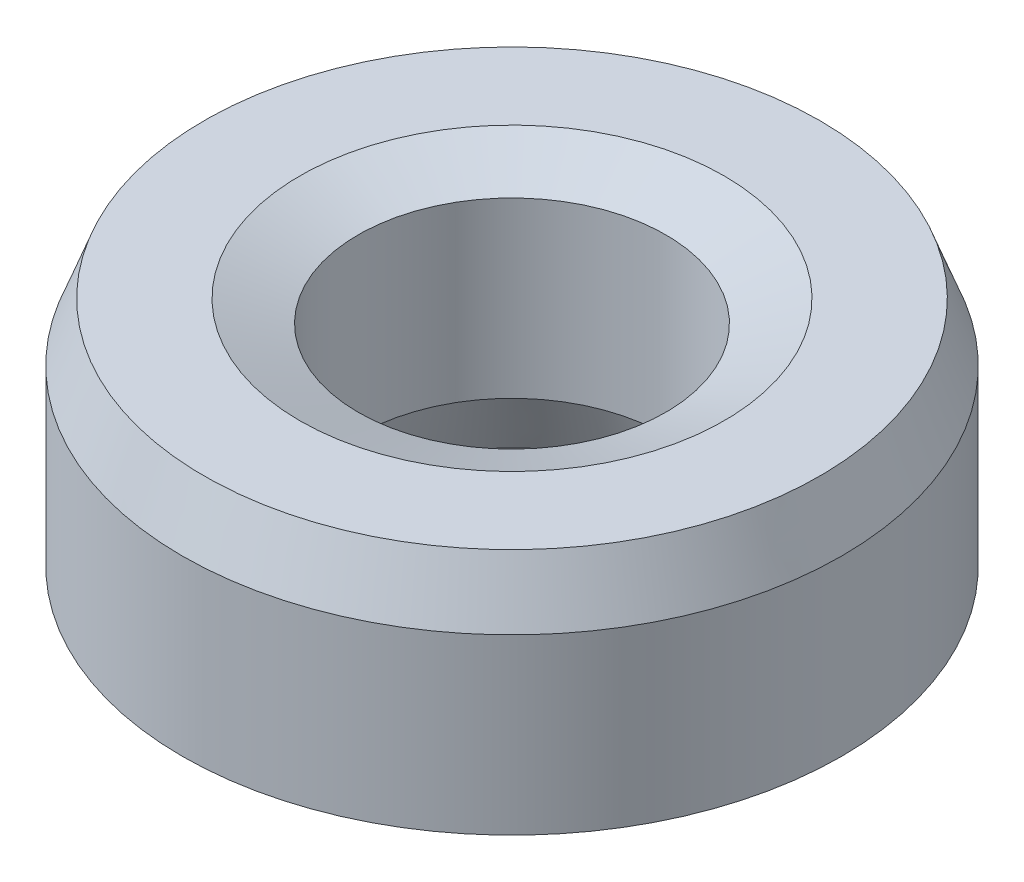
ISO-10303-21;
HEADER;
FILE_DESCRIPTION(('STEP AP214'),'2;1');
FILE_NAME('part.step','',(''),(''),'','','');
FILE_SCHEMA(('AUTOMOTIVE_DESIGN { 1 0 10303 214 1 1 1 1 }'));
ENDSEC;
DATA;
#1=APPLICATION_CONTEXT('core data for automotive mechanical design processes');
#2=APPLICATION_PROTOCOL_DEFINITION('international standard','automotive_design',2000,#1);
#3=PRODUCT_CONTEXT('',#1,'mechanical');
#4=PRODUCT('Part','Part','',(#3));
#5=PRODUCT_RELATED_PRODUCT_CATEGORY('part','',(#4));
#6=PRODUCT_DEFINITION_FORMATION('','',#4);
#7=PRODUCT_DEFINITION_CONTEXT('part definition',#1,'design');
#8=PRODUCT_DEFINITION('design','',#6,#7);
#9=PRODUCT_DEFINITION_SHAPE('','',#8);
#10=(LENGTH_UNIT() NAMED_UNIT(*) SI_UNIT(.MILLI.,.METRE.));
#11=(NAMED_UNIT(*) PLANE_ANGLE_UNIT() SI_UNIT($,.RADIAN.));
#12=(NAMED_UNIT(*) SI_UNIT($,.STERADIAN.) SOLID_ANGLE_UNIT());
#13=UNCERTAINTY_MEASURE_WITH_UNIT(LENGTH_MEASURE(1.E-05),#10,'distance_accuracy_value','');
#14=(GEOMETRIC_REPRESENTATION_CONTEXT(3) GLOBAL_UNCERTAINTY_ASSIGNED_CONTEXT((#13)) GLOBAL_UNIT_ASSIGNED_CONTEXT((#10,
#11,#12)) REPRESENTATION_CONTEXT('',''));
#15=CARTESIAN_POINT('',(0.,0.,0.));
#16=DIRECTION('',(0.,0.,1.));
#17=DIRECTION('',(1.,0.,0.));
#18=AXIS2_PLACEMENT_3D('',#15,#16,#17);
#19=CARTESIAN_POINT('',(0.,7.6941855926446,0.));
#20=DIRECTION('',(0.,-1.,0.));
#21=DIRECTION('',(0.,0.,-1.));
#22=AXIS2_PLACEMENT_3D('',#19,#20,#21);
#23=CYLINDRICAL_SURFACE('',#22,10.);
#24=CARTESIAN_POINT('',(0.,0.662846741492348,0.));
#25=DIRECTION('',(0.,1.,0.));
#26=DIRECTION('',(0.,0.,1.));
#27=AXIS2_PLACEMENT_3D('',#24,#25,#26);
#28=CIRCLE('',#27,10.);
#29=CARTESIAN_POINT('',(0.,0.662846741492348,10.));
#30=VERTEX_POINT('',#29);
#31=EDGE_CURVE('E10',#30,#30,#28,.T.);
#32=ORIENTED_EDGE('',*,*,#31,.T.);
#33=EDGE_LOOP('',(#32));
#34=FACE_BOUND('',#33,.T.);
#35=CARTESIAN_POINT('',(0.,5.92451354633449,0.));
#36=DIRECTION('',(0.,1.,0.));
#37=DIRECTION('',(0.,0.,1.));
#38=AXIS2_PLACEMENT_3D('',#35,#36,#37);
#39=CIRCLE('',#38,10.);
#40=CARTESIAN_POINT('',(0.,5.92451354633449,-10.));
#41=VERTEX_POINT('',#40);
#42=EDGE_CURVE('E50',#41,#41,#39,.F.);
#43=ORIENTED_EDGE('',*,*,#42,.T.);
#44=EDGE_LOOP('',(#43));
#45=FACE_BOUND('',#44,.T.);
#46=ADVANCED_FACE('F39',(#34,#45),#23,.T.);
#47=CARTESIAN_POINT('',(0.,7.6941855926446,0.));
#48=DIRECTION('',(0.,1.,0.));
#49=DIRECTION('',(0.,0.,1.));
#50=AXIS2_PLACEMENT_3D('',#47,#48,#49);
#51=PLANE('',#50);
#52=CARTESIAN_POINT('',(0.,7.6941855926446,0.));
#53=DIRECTION('',(0.,1.,0.));
#54=DIRECTION('',(0.,0.,1.));
#55=AXIS2_PLACEMENT_3D('',#52,#53,#54);
#56=CIRCLE('',#55,6.43451504846257);
#57=CARTESIAN_POINT('',(0.,7.6941855926446,6.43451504846257));
#58=VERTEX_POINT('',#57);
#59=EDGE_CURVE('E58',#58,#58,#56,.F.);
#60=ORIENTED_EDGE('',*,*,#59,.T.);
#61=EDGE_LOOP('',(#60));
#62=FACE_BOUND('',#61,.T.);
#63=CARTESIAN_POINT('',(0.,7.6941855926446,0.));
#64=DIRECTION('',(0.,1.,0.));
#65=DIRECTION('',(0.,0.,1.));
#66=AXIS2_PLACEMENT_3D('',#63,#64,#65);
#67=CIRCLE('',#66,9.33715325850764);
#68=CARTESIAN_POINT('',(0.,7.6941855926446,-9.33715325850764));
#69=VERTEX_POINT('',#68);
#70=EDGE_CURVE('E61',#69,#69,#67,.T.);
#71=ORIENTED_EDGE('',*,*,#70,.T.);
#72=EDGE_LOOP('',(#71));
#73=FACE_BOUND('',#72,.T.);
#74=ADVANCED_FACE('F88',(#62,#73),#51,.T.);
#75=CARTESIAN_POINT('',(0.,0.,0.));
#76=DIRECTION('',(0.,1.,0.));
#77=DIRECTION('',(0.,0.,1.));
#78=AXIS2_PLACEMENT_3D('',#75,#76,#77);
#79=PLANE('',#78);
#80=CARTESIAN_POINT('',(0.,0.,0.));
#81=DIRECTION('',(0.,1.,0.));
#82=DIRECTION('',(0.,0.,1.));
#83=AXIS2_PLACEMENT_3D('',#80,#81,#82);
#84=CIRCLE('',#83,5.32768974364484);
#85=CARTESIAN_POINT('',(0.,0.,5.32768974364484));
#86=VERTEX_POINT('',#85);
#87=EDGE_CURVE('E51',#86,#86,#84,.T.);
#88=ORIENTED_EDGE('',*,*,#87,.T.);
#89=EDGE_LOOP('',(#88));
#90=FACE_BOUND('',#89,.T.);
#91=CARTESIAN_POINT('',(0.,0.,0.));
#92=DIRECTION('',(0.,1.,0.));
#93=DIRECTION('',(0.,0.,1.));
#94=AXIS2_PLACEMENT_3D('',#91,#92,#93);
#95=CIRCLE('',#94,8.23032795368992);
#96=CARTESIAN_POINT('',(0.,0.,8.23032795368992));
#97=VERTEX_POINT('',#96);
#98=EDGE_CURVE('E54',#97,#97,#95,.F.);
#99=ORIENTED_EDGE('',*,*,#98,.T.);
#100=EDGE_LOOP('',(#99));
#101=FACE_BOUND('',#100,.T.);
#102=ADVANCED_FACE('F83',(#90,#101),#79,.F.);
#103=CARTESIAN_POINT('',(0.,7.6941855926446,0.));
#104=DIRECTION('',(0.,-1.,0.));
#105=DIRECTION('',(0.,0.,-1.));
#106=AXIS2_PLACEMENT_3D('',#103,#104,#105);
#107=CYLINDRICAL_SURFACE('',#106,4.66484300215249);
#108=CARTESIAN_POINT('',(0.,7.03133885115225,0.));
#109=DIRECTION('',(0.,1.,0.));
#110=DIRECTION('',(0.,0.,1.));
#111=AXIS2_PLACEMENT_3D('',#108,#109,#110);
#112=CIRCLE('',#111,4.66484300215249);
#113=CARTESIAN_POINT('',(0.,7.03133885115225,4.66484300215249));
#114=VERTEX_POINT('',#113);
#115=EDGE_CURVE('E67',#114,#114,#112,.T.);
#116=ORIENTED_EDGE('',*,*,#115,.T.);
#117=EDGE_LOOP('',(#116));
#118=FACE_BOUND('',#117,.T.);
#119=CARTESIAN_POINT('',(0.,1.76967204631009,0.));
#120=DIRECTION('',(0.,1.,0.));
#121=DIRECTION('',(0.,0.,1.));
#122=AXIS2_PLACEMENT_3D('',#119,#120,#121);
#123=CIRCLE('',#122,4.66484300215249);
#124=CARTESIAN_POINT('',(0.,1.76967204631009,4.66484300215249));
#125=VERTEX_POINT('',#124);
#126=EDGE_CURVE('E69',#125,#125,#123,.F.);
#127=ORIENTED_EDGE('',*,*,#126,.T.);
#128=EDGE_LOOP('',(#127));
#129=FACE_BOUND('',#128,.T.);
#130=ADVANCED_FACE('F71',(#118,#129),#107,.F.);
#131=CARTESIAN_POINT('',(0.,7.03133885115225,0.));
#132=DIRECTION('',(0.,1.,0.));
#133=DIRECTION('',(0.,0.,1.));
#134=AXIS2_PLACEMENT_3D('',#131,#132,#133);
#135=CONICAL_SURFACE('',#134,4.66484300215249,1.2124122686218);
#136=ORIENTED_EDGE('',*,*,#59,.F.);
#137=EDGE_LOOP('',(#136));
#138=FACE_BOUND('',#137,.T.);
#139=ORIENTED_EDGE('',*,*,#115,.F.);
#140=EDGE_LOOP('',(#139));
#141=FACE_BOUND('',#140,.T.);
#142=ADVANCED_FACE('F77',(#138,#141),#135,.F.);
#143=CARTESIAN_POINT('',(0.,0.,0.));
#144=DIRECTION('',(0.,-1.,0.));
#145=DIRECTION('',(0.,0.,-1.));
#146=AXIS2_PLACEMENT_3D('',#143,#144,#145);
#147=CONICAL_SURFACE('',#146,5.32768974364484,0.358384058173095);
#148=ORIENTED_EDGE('',*,*,#126,.F.);
#149=EDGE_LOOP('',(#148));
#150=FACE_BOUND('',#149,.T.);
#151=ORIENTED_EDGE('',*,*,#87,.F.);
#152=EDGE_LOOP('',(#151));
#153=FACE_BOUND('',#152,.T.);
#154=ADVANCED_FACE('F73',(#150,#153),#147,.F.);
#155=CARTESIAN_POINT('',(0.,0.662846741492348,0.));
#156=DIRECTION('',(0.,1.,0.));
#157=DIRECTION('',(0.,0.,1.));
#158=AXIS2_PLACEMENT_3D('',#155,#156,#157);
#159=CONICAL_SURFACE('',#158,10.,1.2124122686218);
#160=ORIENTED_EDGE('',*,*,#98,.F.);
#161=EDGE_LOOP('',(#160));
#162=FACE_BOUND('',#161,.T.);
#163=ORIENTED_EDGE('',*,*,#31,.F.);
#164=EDGE_LOOP('',(#163));
#165=FACE_BOUND('',#164,.T.);
#166=ADVANCED_FACE('F76',(#162,#165),#159,.T.);
#167=CARTESIAN_POINT('',(0.,7.6941855926446,0.));
#168=DIRECTION('',(0.,-1.,0.));
#169=DIRECTION('',(0.,0.,-1.));
#170=AXIS2_PLACEMENT_3D('',#167,#168,#169);
#171=CONICAL_SURFACE('',#170,9.33715325850764,0.358384058173095);
#172=CARTESIAN_POINT('',(0.,5.92451354633449,-10.));
#173=CARTESIAN_POINT('',(0.,5.94294763015022,-9.99309534644279));
#174=CARTESIAN_POINT('',(0.,5.96138171396595,-9.98619069288558));
#175=CARTESIAN_POINT('',(0.,5.99824988159741,-9.97238138577115));
#176=CARTESIAN_POINT('',(0.,6.01668396541314,-9.96547673221394));
#177=CARTESIAN_POINT('',(0.,6.0535521330446,-9.95166742509952));
#178=CARTESIAN_POINT('',(0.,6.07198621686033,-9.9447627715423));
#179=CARTESIAN_POINT('',(0.,6.10885438449179,-9.93095346442788));
#180=CARTESIAN_POINT('',(0.,6.12728846830752,-9.92404881087067));
#181=CARTESIAN_POINT('',(0.,6.16415663593898,-9.91023950375625));
#182=CARTESIAN_POINT('',(0.,6.18259071975471,-9.90333485019903));
#183=CARTESIAN_POINT('',(0.,6.21945888738617,-9.88952554308461));
#184=CARTESIAN_POINT('',(0.,6.2378929712019,-9.8826208895274));
#185=CARTESIAN_POINT('',(0.,6.27476113883337,-9.86881158241297));
#186=CARTESIAN_POINT('',(0.,6.29319522264909,-9.86190692885576));
#187=CARTESIAN_POINT('',(0.,6.33006339028056,-9.84809762174134));
#188=CARTESIAN_POINT('',(0.,6.34849747409629,-9.84119296818412));
#189=CARTESIAN_POINT('',(0.,6.38536564172775,-9.8273836610697));
#190=CARTESIAN_POINT('',(0.,6.40379972554348,-9.82047900751249));
#191=CARTESIAN_POINT('',(0.,6.44066789317494,-9.80666970039806));
#192=CARTESIAN_POINT('',(0.,6.45910197699067,-9.79976504684085));
#193=CARTESIAN_POINT('',(0.,6.49597014462213,-9.78595573972643));
#194=CARTESIAN_POINT('',(0.,6.51440422843786,-9.77905108616922));
#195=CARTESIAN_POINT('',(0.,6.55127239606932,-9.76524177905479));
#196=CARTESIAN_POINT('',(0.,6.56970647988505,-9.75833712549758));
#197=CARTESIAN_POINT('',(0.,6.60657464751651,-9.74452781838316));
#198=CARTESIAN_POINT('',(0.,6.62500873133224,-9.73762316482594));
#199=CARTESIAN_POINT('',(0.,6.6618768989637,-9.72381385771152));
#200=CARTESIAN_POINT('',(0.,6.68031098277943,-9.71690920415431));
#201=CARTESIAN_POINT('',(0.,6.71717915041089,-9.70309989703988));
#202=CARTESIAN_POINT('',(0.,6.73561323422662,-9.69619524348267));
#203=CARTESIAN_POINT('',(0.,6.77248140185808,-9.68238593636825));
#204=CARTESIAN_POINT('',(0.,6.79091548567381,-9.67548128281104));
#205=CARTESIAN_POINT('',(0.,6.82778365330527,-9.66167197569661));
#206=CARTESIAN_POINT('',(0.,6.846217737121,-9.6547673221394));
#207=CARTESIAN_POINT('',(0.,6.88308590475247,-9.64095801502498));
#208=CARTESIAN_POINT('',(0.,6.9015199885682,-9.63405336146776));
#209=CARTESIAN_POINT('',(0.,6.93838815619966,-9.62024405435334));
#210=CARTESIAN_POINT('',(0.,6.95682224001539,-9.61333940079613));
#211=CARTESIAN_POINT('',(0.,6.99369040764685,-9.5995300936817));
#212=CARTESIAN_POINT('',(0.,7.01212449146258,-9.59262544012449));
#213=CARTESIAN_POINT('',(0.,7.04899265909404,-9.57881613301007));
#214=CARTESIAN_POINT('',(0.,7.06742674290977,-9.57191147945285));
#215=CARTESIAN_POINT('',(0.,7.10429491054123,-9.55810217233843));
#216=CARTESIAN_POINT('',(0.,7.12272899435696,-9.55119751878122));
#217=CARTESIAN_POINT('',(0.,7.15959716198842,-9.53738821166679));
#218=CARTESIAN_POINT('',(0.,7.17803124580415,-9.53048355810958));
#219=CARTESIAN_POINT('',(0.,7.21489941343561,-9.51667425099516));
#220=CARTESIAN_POINT('',(0.,7.23333349725134,-9.50976959743795));
#221=CARTESIAN_POINT('',(0.,7.2702016648828,-9.49596029032352));
#222=CARTESIAN_POINT('',(0.,7.28863574869853,-9.48905563676631));
#223=CARTESIAN_POINT('',(0.,7.32550391632999,-9.47524632965188));
#224=CARTESIAN_POINT('',(0.,7.34393800014572,-9.46834167609467));
#225=CARTESIAN_POINT('',(0.,7.38080616777718,-9.45453236898025));
#226=CARTESIAN_POINT('',(0.,7.39924025159292,-9.44762771542304));
#227=CARTESIAN_POINT('',(0.,7.43610841922438,-9.43381840830861));
#228=CARTESIAN_POINT('',(0.,7.45454250304011,-9.4269137547514));
#229=CARTESIAN_POINT('',(0.,7.49141067067157,-9.41310444763698));
#230=CARTESIAN_POINT('',(0.,7.5098447544873,-9.40619979407977));
#231=CARTESIAN_POINT('',(0.,7.54671292211876,-9.39239048696534));
#232=CARTESIAN_POINT('',(0.,7.56514700593449,-9.38548583340813));
#233=CARTESIAN_POINT('',(0.,7.60201517356595,-9.37167652629371));
#234=CARTESIAN_POINT('',(0.,7.62044925738168,-9.36477187273649));
#235=CARTESIAN_POINT('',(0.,7.65731742501314,-9.35096256562207));
#236=CARTESIAN_POINT('',(0.,7.67575150882887,-9.34405791206486));
#237=CARTESIAN_POINT('',(0.,7.6941855926446,-9.33715325850764));
#238=B_SPLINE_CURVE_WITH_KNOTS('',3,(#172,#173,#174,#175,#176,#177,#178,#179,#180,#181,#182,
#183,#184,#185,#186,#187,#188,#189,#190,#191,#192,#193,#194,#195,#196,#197,#198,#199,#200,#201,
#202,#203,#204,#205,#206,#207,#208,#209,#210,#211,#212,#213,#214,#215,#216,#217,#218,#219,#220,
#221,#222,#223,#224,#225,#226,#227,#228,#229,#230,#231,#232,#233,#234,#235,#236,#237),
.UNSPECIFIED.,.F.,.F.,(4,2,2,2,2,2,2,2,2,2,2,2,2,2,2,2,2,2,2,2,2,2,2,2,2,2,2,2,2,2,2,2,4),(0.,
0.0590542731886057,0.118108546377211,0.177162819565816,0.236217092754421,0.295271365943027,
0.354325639131632,0.413379912320237,0.472434185508842,0.531488458697448,0.590542731886054,
0.649597005074658,0.708651278263264,0.76770555145187,0.826759824640475,0.88581409782908,
0.944868371017685,1.00392264420629,1.0629769173949,1.1220311905835,1.18108546377211,
1.24013973696071,1.29919401014932,1.35824828333792,1.41730255652653,1.47635682971513,
1.53541110290374,1.59446537609234,1.65351964928095,1.71257392246955,1.77162819565816,
1.83068246884676,1.88973674203537),.UNSPECIFIED.);
#239=EDGE_CURVE('BSEAM45',#41,#69,#238,.T.);
#240=ORIENTED_EDGE('',*,*,#42,.F.);
#241=ORIENTED_EDGE('',*,*,#70,.F.);
#242=ORIENTED_EDGE('',*,*,#239,.T.);
#243=ORIENTED_EDGE('',*,*,#239,.F.);
#244=EDGE_LOOP('',(#240,#242,#241,#243));
#245=FACE_BOUND('',#244,.T.);
#246=ADVANCED_FACE('F45',(#245),#171,.T.);
#247=CLOSED_SHELL('',(#46,#74,#102,#130,#142,#154,#166,#246));
#248=MANIFOLD_SOLID_BREP('B2',#247);
#249=ADVANCED_BREP_SHAPE_REPRESENTATION('',(#18,#248),#14);
#250=SHAPE_DEFINITION_REPRESENTATION(#9,#249);
ENDSEC;
END-ISO-10303-21;
